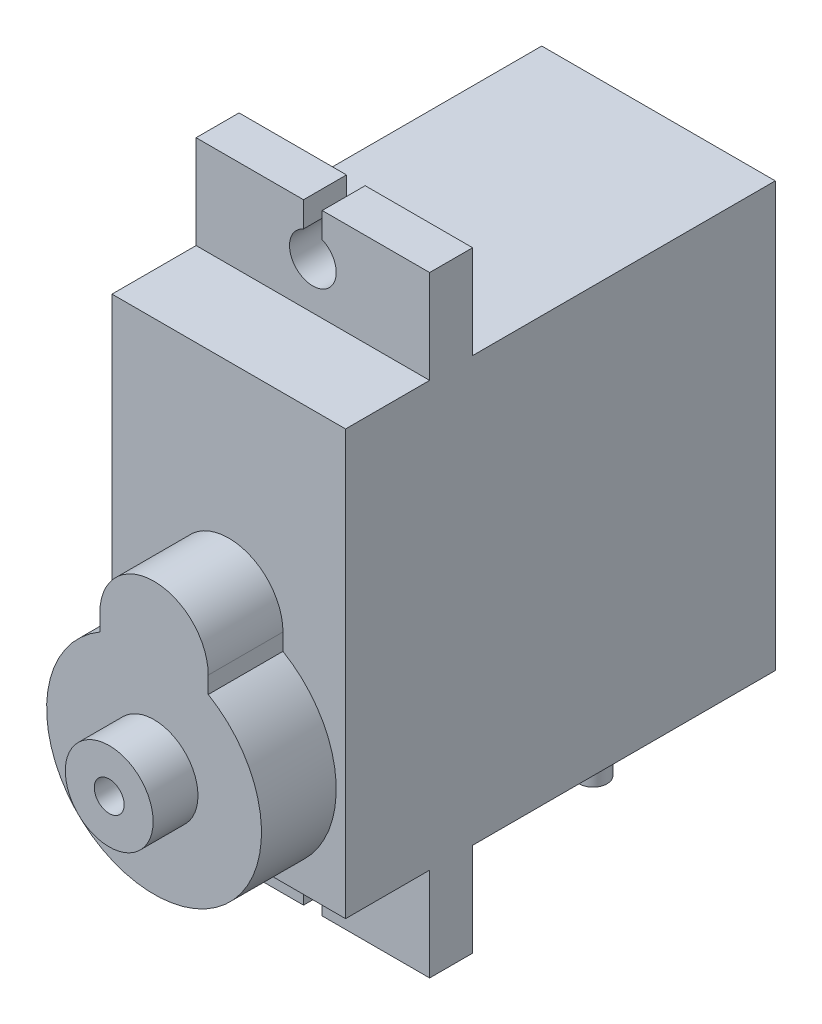
ISO-10303-21;
HEADER;
FILE_DESCRIPTION(('STEP AP214'),'2;1');
FILE_NAME('part.step','',(''),(''),'','','');
FILE_SCHEMA(('AUTOMOTIVE_DESIGN { 1 0 10303 214 1 1 1 1 }'));
ENDSEC;
DATA;
#1=APPLICATION_CONTEXT('core data for automotive mechanical design processes');
#2=APPLICATION_PROTOCOL_DEFINITION('international standard','automotive_design',2000,#1);
#3=PRODUCT_CONTEXT('',#1,'mechanical');
#4=PRODUCT('Part','Part','',(#3));
#5=PRODUCT_RELATED_PRODUCT_CATEGORY('part','',(#4));
#6=PRODUCT_DEFINITION_FORMATION('','',#4);
#7=PRODUCT_DEFINITION_CONTEXT('part definition',#1,'design');
#8=PRODUCT_DEFINITION('design','',#6,#7);
#9=PRODUCT_DEFINITION_SHAPE('','',#8);
#10=(LENGTH_UNIT() NAMED_UNIT(*) SI_UNIT(.MILLI.,.METRE.));
#11=(NAMED_UNIT(*) PLANE_ANGLE_UNIT() SI_UNIT($,.RADIAN.));
#12=(NAMED_UNIT(*) SI_UNIT($,.STERADIAN.) SOLID_ANGLE_UNIT());
#13=UNCERTAINTY_MEASURE_WITH_UNIT(LENGTH_MEASURE(1.E-05),#10,'distance_accuracy_value','');
#14=(GEOMETRIC_REPRESENTATION_CONTEXT(3) GLOBAL_UNCERTAINTY_ASSIGNED_CONTEXT((#13)) GLOBAL_UNIT_ASSIGNED_CONTEXT((#10,
#11,#12)) REPRESENTATION_CONTEXT('',''));
#15=CARTESIAN_POINT('',(0.,0.,0.));
#16=DIRECTION('',(0.,0.,1.));
#17=DIRECTION('',(1.,0.,0.));
#18=AXIS2_PLACEMENT_3D('',#15,#16,#17);
#19=CARTESIAN_POINT('',(-6.25000000000001,-11.35,23.));
#20=DIRECTION('',(0.,1.,0.));
#21=DIRECTION('',(0.,0.,1.));
#22=AXIS2_PLACEMENT_3D('',#19,#20,#21);
#23=PLANE('',#22);
#24=DIRECTION('',(-1.,0.,0.));
#25=VECTOR('',#24,1.);
#26=CARTESIAN_POINT('',(6.25,-11.35,16.2));
#27=LINE('',#26,#25);
#28=CARTESIAN_POINT('',(6.24999999999999,-11.35,16.2));
#29=VERTEX_POINT('',#28);
#30=CARTESIAN_POINT('',(-6.25,-11.35,16.2));
#31=VERTEX_POINT('',#30);
#32=EDGE_CURVE('E324',#29,#31,#27,.T.);
#33=ORIENTED_EDGE('',*,*,#32,.T.);
#34=DIRECTION('',(0.,0.,-1.));
#35=VECTOR('',#34,1.);
#36=CARTESIAN_POINT('',(-6.25000000000001,-11.35,23.));
#37=LINE('',#36,#35);
#38=CARTESIAN_POINT('',(-6.25000000000001,-11.35,0.));
#39=VERTEX_POINT('',#38);
#40=EDGE_CURVE('E399',#31,#39,#37,.T.);
#41=ORIENTED_EDGE('',*,*,#40,.T.);
#42=DIRECTION('',(1.,0.,0.));
#43=VECTOR('',#42,1.);
#44=CARTESIAN_POINT('',(-6.25000000000001,-11.35,0.));
#45=LINE('',#44,#43);
#46=CARTESIAN_POINT('',(6.24999999999999,-11.35,0.));
#47=VERTEX_POINT('',#46);
#48=EDGE_CURVE('E494',#39,#47,#45,.T.);
#49=ORIENTED_EDGE('',*,*,#48,.T.);
#50=DIRECTION('',(0.,0.,-1.));
#51=VECTOR('',#50,1.);
#52=CARTESIAN_POINT('',(6.24999999999999,-11.35,23.));
#53=LINE('',#52,#51);
#54=EDGE_CURVE('E487',#29,#47,#53,.T.);
#55=ORIENTED_EDGE('',*,*,#54,.F.);
#56=EDGE_LOOP('',(#33,#41,#49,#55));
#57=FACE_BOUND('',#56,.T.);
#58=CARTESIAN_POINT('',(1.25,-11.35,4.75));
#59=DIRECTION('',(0.,1.,0.));
#60=DIRECTION('',(0.,0.,1.));
#61=AXIS2_PLACEMENT_3D('',#58,#59,#60);
#62=CIRCLE('',#61,0.75);
#63=CARTESIAN_POINT('',(0.625,-11.35,4.33542190120558));
#64=VERTEX_POINT('',#63);
#65=CARTESIAN_POINT('',(0.625000000000001,-11.35,5.16457809879443));
#66=VERTEX_POINT('',#65);
#67=EDGE_CURVE('E236',#64,#66,#62,.F.);
#68=ORIENTED_EDGE('',*,*,#67,.F.);
#69=CARTESIAN_POINT('',(0.,-11.35,4.75));
#70=DIRECTION('',(0.,1.,0.));
#71=DIRECTION('',(0.,0.,1.));
#72=AXIS2_PLACEMENT_3D('',#69,#70,#71);
#73=CIRCLE('',#72,0.75);
#74=CARTESIAN_POINT('',(-0.625,-11.35,4.33542190120558));
#75=VERTEX_POINT('',#74);
#76=EDGE_CURVE('E248',#75,#64,#73,.F.);
#77=ORIENTED_EDGE('',*,*,#76,.F.);
#78=CARTESIAN_POINT('',(-1.25,-11.35,4.75));
#79=DIRECTION('',(0.,1.,0.));
#80=DIRECTION('',(0.,0.,1.));
#81=AXIS2_PLACEMENT_3D('',#78,#79,#80);
#82=CIRCLE('',#81,0.75);
#83=CARTESIAN_POINT('',(-0.625,-11.35,5.16457809879442));
#84=VERTEX_POINT('',#83);
#85=EDGE_CURVE('E235',#84,#75,#82,.F.);
#86=ORIENTED_EDGE('',*,*,#85,.F.);
#87=CARTESIAN_POINT('',(0.,-11.35,4.75));
#88=DIRECTION('',(0.,1.,0.));
#89=DIRECTION('',(0.,0.,1.));
#90=AXIS2_PLACEMENT_3D('',#87,#88,#89);
#91=CIRCLE('',#90,0.75);
#92=EDGE_CURVE('E225',#66,#84,#91,.F.);
#93=ORIENTED_EDGE('',*,*,#92,.F.);
#94=EDGE_LOOP('',(#68,#77,#86,#93));
#95=FACE_BOUND('',#94,.T.);
#96=ADVANCED_FACE('F35',(#57,#95),#23,.F.);
#97=CARTESIAN_POINT('',(6.25,-16.35,16.2));
#98=DIRECTION('',(0.,1.,0.));
#99=DIRECTION('',(0.,0.,1.));
#100=AXIS2_PLACEMENT_3D('',#97,#98,#99);
#101=PLANE('',#100);
#102=DIRECTION('',(-1.,0.,0.));
#103=VECTOR('',#102,1.);
#104=CARTESIAN_POINT('',(6.25,-16.35,18.5));
#105=LINE('',#104,#103);
#106=CARTESIAN_POINT('',(6.25,-16.35,18.5));
#107=VERTEX_POINT('',#106);
#108=CARTESIAN_POINT('',(0.5,-16.35,18.5));
#109=VERTEX_POINT('',#108);
#110=EDGE_CURVE('E339',#107,#109,#105,.T.);
#111=ORIENTED_EDGE('',*,*,#110,.T.);
#112=DIRECTION('',(0.,0.,1.));
#113=VECTOR('',#112,1.);
#114=CARTESIAN_POINT('',(0.5,-16.35,-0.00102500000000172));
#115=LINE('',#114,#113);
#116=CARTESIAN_POINT('',(0.5,-16.35,16.2));
#117=VERTEX_POINT('',#116);
#118=EDGE_CURVE('E287',#117,#109,#115,.T.);
#119=ORIENTED_EDGE('',*,*,#118,.F.);
#120=DIRECTION('',(-1.,0.,0.));
#121=VECTOR('',#120,1.);
#122=CARTESIAN_POINT('',(6.25,-16.35,16.2));
#123=LINE('',#122,#121);
#124=CARTESIAN_POINT('',(6.25,-16.35,16.2));
#125=VERTEX_POINT('',#124);
#126=EDGE_CURVE('E335',#125,#117,#123,.T.);
#127=ORIENTED_EDGE('',*,*,#126,.F.);
#128=DIRECTION('',(0.,0.,-1.));
#129=VECTOR('',#128,1.);
#130=CARTESIAN_POINT('',(6.25,-16.35,16.2));
#131=LINE('',#130,#129);
#132=EDGE_CURVE('E318',#107,#125,#131,.T.);
#133=ORIENTED_EDGE('',*,*,#132,.F.);
#134=EDGE_LOOP('',(#111,#119,#127,#133));
#135=FACE_BOUND('',#134,.T.);
#136=ADVANCED_FACE('F559',(#135),#101,.F.);
#137=CARTESIAN_POINT('',(6.25,16.35,16.2));
#138=DIRECTION('',(0.,-1.,0.));
#139=DIRECTION('',(0.,0.,-1.));
#140=AXIS2_PLACEMENT_3D('',#137,#138,#139);
#141=PLANE('',#140);
#142=DIRECTION('',(-1.,0.,0.));
#143=VECTOR('',#142,1.);
#144=CARTESIAN_POINT('',(6.25,16.35,16.2));
#145=LINE('',#144,#143);
#146=CARTESIAN_POINT('',(6.25,16.35,16.2));
#147=VERTEX_POINT('',#146);
#148=CARTESIAN_POINT('',(0.5,16.35,16.2));
#149=VERTEX_POINT('',#148);
#150=EDGE_CURVE('E453',#147,#149,#145,.T.);
#151=ORIENTED_EDGE('',*,*,#150,.T.);
#152=DIRECTION('',(0.,0.,1.));
#153=VECTOR('',#152,1.);
#154=CARTESIAN_POINT('',(0.5,16.35,-0.00102500000000172));
#155=LINE('',#154,#153);
#156=CARTESIAN_POINT('',(0.5,16.35,18.5));
#157=VERTEX_POINT('',#156);
#158=EDGE_CURVE('E307',#149,#157,#155,.T.);
#159=ORIENTED_EDGE('',*,*,#158,.T.);
#160=DIRECTION('',(-1.,0.,0.));
#161=VECTOR('',#160,1.);
#162=CARTESIAN_POINT('',(6.25,16.35,18.5));
#163=LINE('',#162,#161);
#164=CARTESIAN_POINT('',(6.25,16.35,18.5));
#165=VERTEX_POINT('',#164);
#166=EDGE_CURVE('E466',#165,#157,#163,.T.);
#167=ORIENTED_EDGE('',*,*,#166,.F.);
#168=DIRECTION('',(0.,0.,1.));
#169=VECTOR('',#168,1.);
#170=CARTESIAN_POINT('',(6.25,16.35,16.2));
#171=LINE('',#170,#169);
#172=EDGE_CURVE('E346',#147,#165,#171,.T.);
#173=ORIENTED_EDGE('',*,*,#172,.F.);
#174=EDGE_LOOP('',(#151,#159,#167,#173));
#175=FACE_BOUND('',#174,.T.);
#176=ADVANCED_FACE('F564',(#175),#141,.F.);
#177=DIRECTION('',(-1.,0.,0.));
#178=VECTOR('',#177,1.);
#179=CARTESIAN_POINT('',(6.25,-11.35,18.5));
#180=LINE('',#179,#178);
#181=CARTESIAN_POINT('',(6.24999999999999,-11.35,18.5));
#182=VERTEX_POINT('',#181);
#183=CARTESIAN_POINT('',(-6.25000000000001,-11.35,18.5));
#184=VERTEX_POINT('',#183);
#185=EDGE_CURVE('E342',#182,#184,#180,.T.);
#186=ORIENTED_EDGE('',*,*,#185,.F.);
#187=CARTESIAN_POINT('',(6.24999999999999,-11.35,23.));
#188=VERTEX_POINT('',#187);
#189=EDGE_CURVE('E496',#188,#182,#53,.T.);
#190=ORIENTED_EDGE('',*,*,#189,.F.);
#191=DIRECTION('',(1.,0.,0.));
#192=VECTOR('',#191,1.);
#193=CARTESIAN_POINT('',(-6.25000000000001,-11.35,23.));
#194=LINE('',#193,#192);
#195=CARTESIAN_POINT('',(0.,-11.35,23.));
#196=VERTEX_POINT('',#195);
#197=EDGE_CURVE('E479',#196,#188,#194,.T.);
#198=ORIENTED_EDGE('',*,*,#197,.F.);
#199=CARTESIAN_POINT('',(-6.25000000000001,-11.35,23.));
#200=VERTEX_POINT('',#199);
#201=EDGE_CURVE('E481',#200,#196,#194,.T.);
#202=ORIENTED_EDGE('',*,*,#201,.F.);
#203=EDGE_CURVE('E394',#200,#184,#37,.T.);
#204=ORIENTED_EDGE('',*,*,#203,.T.);
#205=EDGE_LOOP('',(#186,#190,#198,#202,#204));
#206=FACE_BOUND('',#205,.T.);
#207=ADVANCED_FACE('F521',(#206),#23,.F.);
#208=CARTESIAN_POINT('',(-6.25000000000001,11.35,23.));
#209=DIRECTION('',(0.,-1.,0.));
#210=DIRECTION('',(0.,0.,-1.));
#211=AXIS2_PLACEMENT_3D('',#208,#209,#210);
#212=PLANE('',#211);
#213=DIRECTION('',(-1.,0.,0.));
#214=VECTOR('',#213,1.);
#215=CARTESIAN_POINT('',(6.25,11.35,16.2));
#216=LINE('',#215,#214);
#217=CARTESIAN_POINT('',(6.25,11.35,16.2));
#218=VERTEX_POINT('',#217);
#219=CARTESIAN_POINT('',(-6.25,11.35,16.2));
#220=VERTEX_POINT('',#219);
#221=EDGE_CURVE('E359',#218,#220,#216,.T.);
#222=ORIENTED_EDGE('',*,*,#221,.F.);
#223=DIRECTION('',(0.,0.,-1.));
#224=VECTOR('',#223,1.);
#225=CARTESIAN_POINT('',(6.24999999999999,11.35,23.));
#226=LINE('',#225,#224);
#227=CARTESIAN_POINT('',(6.24999999999999,11.35,0.));
#228=VERTEX_POINT('',#227);
#229=EDGE_CURVE('E397',#218,#228,#226,.T.);
#230=ORIENTED_EDGE('',*,*,#229,.T.);
#231=DIRECTION('',(-1.,0.,0.));
#232=VECTOR('',#231,1.);
#233=CARTESIAN_POINT('',(-6.25000000000001,11.35,0.));
#234=LINE('',#233,#232);
#235=CARTESIAN_POINT('',(-6.25000000000001,11.35,0.));
#236=VERTEX_POINT('',#235);
#237=EDGE_CURVE('E391',#228,#236,#234,.T.);
#238=ORIENTED_EDGE('',*,*,#237,.T.);
#239=DIRECTION('',(0.,0.,-1.));
#240=VECTOR('',#239,1.);
#241=CARTESIAN_POINT('',(-6.25000000000001,11.35,23.));
#242=LINE('',#241,#240);
#243=EDGE_CURVE('E384',#220,#236,#242,.T.);
#244=ORIENTED_EDGE('',*,*,#243,.F.);
#245=EDGE_LOOP('',(#222,#230,#238,#244));
#246=FACE_BOUND('',#245,.T.);
#247=ADVANCED_FACE('F388',(#246),#212,.F.);
#248=CARTESIAN_POINT('',(0.,0.,23.));
#249=DIRECTION('',(0.,0.,-1.));
#250=DIRECTION('',(-1.,0.,0.));
#251=AXIS2_PLACEMENT_3D('',#248,#249,#250);
#252=PLANE('',#251);
#253=DIRECTION('',(0.,1.,0.));
#254=VECTOR('',#253,1.);
#255=CARTESIAN_POINT('',(2.9,0.26512839713135,23.));
#256=LINE('',#255,#254);
#257=CARTESIAN_POINT('',(2.9,-0.634871602868653,23.));
#258=VERTEX_POINT('',#257);
#259=CARTESIAN_POINT('',(2.9,0.26512839713135,23.));
#260=VERTEX_POINT('',#259);
#261=EDGE_CURVE('E442',#258,#260,#256,.T.);
#262=ORIENTED_EDGE('',*,*,#261,.F.);
#263=CARTESIAN_POINT('',(0.,-5.59999999999999,23.));
#264=DIRECTION('',(0.,0.,1.));
#265=DIRECTION('',(1.,0.,0.));
#266=AXIS2_PLACEMENT_3D('',#263,#264,#265);
#267=CIRCLE('',#266,5.75);
#268=EDGE_CURVE('E43',#196,#258,#267,.T.);
#269=ORIENTED_EDGE('',*,*,#268,.F.);
#270=ORIENTED_EDGE('',*,*,#197,.T.);
#271=DIRECTION('',(0.,1.,0.));
#272=VECTOR('',#271,1.);
#273=CARTESIAN_POINT('',(6.24999999999999,-11.35,23.));
#274=LINE('',#273,#272);
#275=CARTESIAN_POINT('',(6.24999999999999,11.35,23.));
#276=VERTEX_POINT('',#275);
#277=EDGE_CURVE('E483',#188,#276,#274,.T.);
#278=ORIENTED_EDGE('',*,*,#277,.T.);
#279=DIRECTION('',(-1.,0.,0.));
#280=VECTOR('',#279,1.);
#281=CARTESIAN_POINT('',(-6.25000000000001,11.35,23.));
#282=LINE('',#281,#280);
#283=CARTESIAN_POINT('',(-6.25000000000001,11.35,23.));
#284=VERTEX_POINT('',#283);
#285=EDGE_CURVE('E431',#276,#284,#282,.T.);
#286=ORIENTED_EDGE('',*,*,#285,.T.);
#287=DIRECTION('',(0.,-1.,0.));
#288=VECTOR('',#287,1.);
#289=CARTESIAN_POINT('',(-6.25000000000001,-11.35,23.));
#290=LINE('',#289,#288);
#291=EDGE_CURVE('E474',#284,#200,#290,.T.);
#292=ORIENTED_EDGE('',*,*,#291,.T.);
#293=ORIENTED_EDGE('',*,*,#201,.T.);
#294=CARTESIAN_POINT('',(-2.9,-0.634871602868654,23.));
#295=VERTEX_POINT('',#294);
#296=EDGE_CURVE('E435',#295,#196,#267,.T.);
#297=ORIENTED_EDGE('',*,*,#296,.F.);
#298=DIRECTION('',(0.,-1.,0.));
#299=VECTOR('',#298,1.);
#300=CARTESIAN_POINT('',(-2.9,0.26512839713135,23.));
#301=LINE('',#300,#299);
#302=CARTESIAN_POINT('',(-2.9,0.26512839713135,23.));
#303=VERTEX_POINT('',#302);
#304=EDGE_CURVE('E443',#303,#295,#301,.T.);
#305=ORIENTED_EDGE('',*,*,#304,.F.);
#306=CARTESIAN_POINT('',(0.,0.26512839713135,23.));
#307=DIRECTION('',(0.,0.,1.));
#308=DIRECTION('',(1.,0.,0.));
#309=AXIS2_PLACEMENT_3D('',#306,#307,#308);
#310=CIRCLE('',#309,2.9);
#311=EDGE_CURVE('E448',#260,#303,#310,.T.);
#312=ORIENTED_EDGE('',*,*,#311,.F.);
#313=EDGE_LOOP('',(#262,#269,#270,#278,#286,#292,#293,#297,#305,#312));
#314=FACE_BOUND('',#313,.T.);
#315=ADVANCED_FACE('F523',(#314),#252,.F.);
#316=CARTESIAN_POINT('',(6.24999999999999,-11.35,23.));
#317=DIRECTION('',(-1.,0.,0.));
#318=DIRECTION('',(0.,0.,1.));
#319=AXIS2_PLACEMENT_3D('',#316,#317,#318);
#320=PLANE('',#319);
#321=DIRECTION('',(0.,1.,0.));
#322=VECTOR('',#321,1.);
#323=CARTESIAN_POINT('',(6.24999999999999,-11.35,0.));
#324=LINE('',#323,#322);
#325=EDGE_CURVE('E488',#47,#228,#324,.T.);
#326=ORIENTED_EDGE('',*,*,#325,.T.);
#327=ORIENTED_EDGE('',*,*,#229,.F.);
#328=DIRECTION('',(0.,1.,0.));
#329=VECTOR('',#328,1.);
#330=CARTESIAN_POINT('',(6.25,11.35,16.2));
#331=LINE('',#330,#329);
#332=EDGE_CURVE('E349',#218,#147,#331,.T.);
#333=ORIENTED_EDGE('',*,*,#332,.T.);
#334=ORIENTED_EDGE('',*,*,#172,.T.);
#335=DIRECTION('',(0.,-1.,0.));
#336=VECTOR('',#335,1.);
#337=CARTESIAN_POINT('',(6.25,11.35,18.5));
#338=LINE('',#337,#336);
#339=CARTESIAN_POINT('',(6.25,11.35,18.5));
#340=VERTEX_POINT('',#339);
#341=EDGE_CURVE('E348',#165,#340,#338,.T.);
#342=ORIENTED_EDGE('',*,*,#341,.T.);
#343=EDGE_CURVE('E404',#276,#340,#226,.T.);
#344=ORIENTED_EDGE('',*,*,#343,.F.);
#345=ORIENTED_EDGE('',*,*,#277,.F.);
#346=ORIENTED_EDGE('',*,*,#189,.T.);
#347=DIRECTION('',(0.,-1.,0.));
#348=VECTOR('',#347,1.);
#349=CARTESIAN_POINT('',(6.25,-11.35,18.5));
#350=LINE('',#349,#348);
#351=EDGE_CURVE('E316',#182,#107,#350,.T.);
#352=ORIENTED_EDGE('',*,*,#351,.T.);
#353=ORIENTED_EDGE('',*,*,#132,.T.);
#354=DIRECTION('',(0.,1.,0.));
#355=VECTOR('',#354,1.);
#356=CARTESIAN_POINT('',(6.25,-11.35,16.2));
#357=LINE('',#356,#355);
#358=EDGE_CURVE('E321',#125,#29,#357,.T.);
#359=ORIENTED_EDGE('',*,*,#358,.T.);
#360=ORIENTED_EDGE('',*,*,#54,.T.);
#361=EDGE_LOOP('',(#326,#327,#333,#334,#342,#344,#345,#346,#352,#353,#359,#360));
#362=FACE_BOUND('',#361,.T.);
#363=ADVANCED_FACE('F37',(#362),#320,.F.);
#364=ORIENTED_EDGE('',*,*,#343,.T.);
#365=DIRECTION('',(-1.,0.,0.));
#366=VECTOR('',#365,1.);
#367=CARTESIAN_POINT('',(6.25,11.35,18.5));
#368=LINE('',#367,#366);
#369=CARTESIAN_POINT('',(-6.25000000000001,11.35,18.5));
#370=VERTEX_POINT('',#369);
#371=EDGE_CURVE('E362',#340,#370,#368,.T.);
#372=ORIENTED_EDGE('',*,*,#371,.T.);
#373=EDGE_CURVE('E393',#284,#370,#242,.T.);
#374=ORIENTED_EDGE('',*,*,#373,.F.);
#375=ORIENTED_EDGE('',*,*,#285,.F.);
#376=EDGE_LOOP('',(#364,#372,#374,#375));
#377=FACE_BOUND('',#376,.T.);
#378=ADVANCED_FACE('F430',(#377),#212,.F.);
#379=CARTESIAN_POINT('',(-6.25000000000001,-11.35,23.));
#380=DIRECTION('',(1.,0.,0.));
#381=DIRECTION('',(0.,0.,-1.));
#382=AXIS2_PLACEMENT_3D('',#379,#380,#381);
#383=PLANE('',#382);
#384=DIRECTION('',(0.,-1.,0.));
#385=VECTOR('',#384,1.);
#386=CARTESIAN_POINT('',(-6.25000000000001,-11.35,0.));
#387=LINE('',#386,#385);
#388=EDGE_CURVE('E492',#236,#39,#387,.T.);
#389=ORIENTED_EDGE('',*,*,#388,.T.);
#390=ORIENTED_EDGE('',*,*,#40,.F.);
#391=DIRECTION('',(0.,1.,0.));
#392=VECTOR('',#391,1.);
#393=CARTESIAN_POINT('',(-6.25,-11.35,16.2));
#394=LINE('',#393,#392);
#395=CARTESIAN_POINT('',(-6.25,-16.35,16.2));
#396=VERTEX_POINT('',#395);
#397=EDGE_CURVE('E319',#396,#31,#394,.T.);
#398=ORIENTED_EDGE('',*,*,#397,.F.);
#399=DIRECTION('',(0.,0.,-1.));
#400=VECTOR('',#399,1.);
#401=CARTESIAN_POINT('',(-6.25,-16.35,16.2));
#402=LINE('',#401,#400);
#403=CARTESIAN_POINT('',(-6.25,-16.35,18.5));
#404=VERTEX_POINT('',#403);
#405=EDGE_CURVE('E327',#404,#396,#402,.T.);
#406=ORIENTED_EDGE('',*,*,#405,.F.);
#407=DIRECTION('',(0.,-1.,0.));
#408=VECTOR('',#407,1.);
#409=CARTESIAN_POINT('',(-6.25,-11.35,18.5));
#410=LINE('',#409,#408);
#411=EDGE_CURVE('E310',#184,#404,#410,.T.);
#412=ORIENTED_EDGE('',*,*,#411,.F.);
#413=ORIENTED_EDGE('',*,*,#203,.F.);
#414=ORIENTED_EDGE('',*,*,#291,.F.);
#415=ORIENTED_EDGE('',*,*,#373,.T.);
#416=DIRECTION('',(0.,-1.,0.));
#417=VECTOR('',#416,1.);
#418=CARTESIAN_POINT('',(-6.25,11.35,18.5));
#419=LINE('',#418,#417);
#420=CARTESIAN_POINT('',(-6.25,16.35,18.5));
#421=VERTEX_POINT('',#420);
#422=EDGE_CURVE('E353',#421,#370,#419,.T.);
#423=ORIENTED_EDGE('',*,*,#422,.F.);
#424=DIRECTION('',(0.,0.,1.));
#425=VECTOR('',#424,1.);
#426=CARTESIAN_POINT('',(-6.25,16.35,16.2));
#427=LINE('',#426,#425);
#428=CARTESIAN_POINT('',(-6.25,16.35,16.2));
#429=VERTEX_POINT('',#428);
#430=EDGE_CURVE('E350',#429,#421,#427,.T.);
#431=ORIENTED_EDGE('',*,*,#430,.F.);
#432=DIRECTION('',(0.,1.,0.));
#433=VECTOR('',#432,1.);
#434=CARTESIAN_POINT('',(-6.25,11.35,16.2));
#435=LINE('',#434,#433);
#436=EDGE_CURVE('E345',#220,#429,#435,.T.);
#437=ORIENTED_EDGE('',*,*,#436,.F.);
#438=ORIENTED_EDGE('',*,*,#243,.T.);
#439=EDGE_LOOP('',(#389,#390,#398,#406,#412,#413,#414,#415,#423,#431,#437,#438));
#440=FACE_BOUND('',#439,.T.);
#441=ADVANCED_FACE('F383',(#440),#383,.F.);
#442=CARTESIAN_POINT('',(0.,0.,0.));
#443=DIRECTION('',(0.,0.,-1.));
#444=DIRECTION('',(-1.,0.,0.));
#445=AXIS2_PLACEMENT_3D('',#442,#443,#444);
#446=PLANE('',#445);
#447=ORIENTED_EDGE('',*,*,#325,.F.);
#448=ORIENTED_EDGE('',*,*,#48,.F.);
#449=ORIENTED_EDGE('',*,*,#388,.F.);
#450=ORIENTED_EDGE('',*,*,#237,.F.);
#451=EDGE_LOOP('',(#447,#448,#449,#450));
#452=FACE_BOUND('',#451,.T.);
#453=ADVANCED_FACE('F506',(#452),#446,.T.);
#454=CARTESIAN_POINT('',(0.,0.26512839713135,27.));
#455=DIRECTION('',(0.,0.,-1.));
#456=DIRECTION('',(-1.,0.,0.));
#457=AXIS2_PLACEMENT_3D('',#454,#455,#456);
#458=CYLINDRICAL_SURFACE('',#457,2.9);
#459=ORIENTED_EDGE('',*,*,#311,.T.);
#460=DIRECTION('',(0.,0.,-1.));
#461=VECTOR('',#460,1.);
#462=CARTESIAN_POINT('',(-2.9,0.26512839713135,27.));
#463=LINE('',#462,#461);
#464=CARTESIAN_POINT('',(-2.9,0.26512839713135,27.));
#465=VERTEX_POINT('',#464);
#466=EDGE_CURVE('E490',#465,#303,#463,.T.);
#467=ORIENTED_EDGE('',*,*,#466,.F.);
#468=CARTESIAN_POINT('',(0.,0.26512839713135,27.));
#469=DIRECTION('',(0.,0.,1.));
#470=DIRECTION('',(1.,0.,0.));
#471=AXIS2_PLACEMENT_3D('',#468,#469,#470);
#472=CIRCLE('',#471,2.9);
#473=CARTESIAN_POINT('',(2.9,0.26512839713135,27.));
#474=VERTEX_POINT('',#473);
#475=EDGE_CURVE('E446',#474,#465,#472,.T.);
#476=ORIENTED_EDGE('',*,*,#475,.F.);
#477=DIRECTION('',(0.,0.,-1.));
#478=VECTOR('',#477,1.);
#479=CARTESIAN_POINT('',(2.9,0.26512839713135,27.));
#480=LINE('',#479,#478);
#481=EDGE_CURVE('E458',#474,#260,#480,.T.);
#482=ORIENTED_EDGE('',*,*,#481,.T.);
#483=EDGE_LOOP('',(#459,#467,#476,#482));
#484=FACE_BOUND('',#483,.T.);
#485=ADVANCED_FACE('F531',(#484),#458,.T.);
#486=CARTESIAN_POINT('',(-2.9,0.26512839713135,27.));
#487=DIRECTION('',(1.,0.,0.));
#488=DIRECTION('',(0.,0.,-1.));
#489=AXIS2_PLACEMENT_3D('',#486,#487,#488);
#490=PLANE('',#489);
#491=ORIENTED_EDGE('',*,*,#304,.T.);
#492=DIRECTION('',(0.,0.,-1.));
#493=VECTOR('',#492,1.);
#494=CARTESIAN_POINT('',(-2.9,-0.634871602868654,27.));
#495=LINE('',#494,#493);
#496=CARTESIAN_POINT('',(-2.9,-0.634871602868654,27.));
#497=VERTEX_POINT('',#496);
#498=EDGE_CURVE('E528',#497,#295,#495,.T.);
#499=ORIENTED_EDGE('',*,*,#498,.F.);
#500=DIRECTION('',(0.,-1.,0.));
#501=VECTOR('',#500,1.);
#502=CARTESIAN_POINT('',(-2.9,0.26512839713135,27.));
#503=LINE('',#502,#501);
#504=EDGE_CURVE('E461',#465,#497,#503,.T.);
#505=ORIENTED_EDGE('',*,*,#504,.F.);
#506=ORIENTED_EDGE('',*,*,#466,.T.);
#507=EDGE_LOOP('',(#491,#499,#505,#506));
#508=FACE_BOUND('',#507,.T.);
#509=ADVANCED_FACE('F525',(#508),#490,.F.);
#510=CARTESIAN_POINT('',(0.,-5.59999999999999,27.));
#511=DIRECTION('',(0.,0.,-1.));
#512=DIRECTION('',(-1.,0.,0.));
#513=AXIS2_PLACEMENT_3D('',#510,#511,#512);
#514=CYLINDRICAL_SURFACE('',#513,5.75);
#515=ORIENTED_EDGE('',*,*,#296,.T.);
#516=ORIENTED_EDGE('',*,*,#268,.T.);
#517=DIRECTION('',(0.,0.,-1.));
#518=VECTOR('',#517,1.);
#519=CARTESIAN_POINT('',(2.9,-0.634871602868653,27.));
#520=LINE('',#519,#518);
#521=CARTESIAN_POINT('',(2.9,-0.634871602868653,27.));
#522=VERTEX_POINT('',#521);
#523=EDGE_CURVE('E535',#522,#258,#520,.T.);
#524=ORIENTED_EDGE('',*,*,#523,.F.);
#525=CARTESIAN_POINT('',(0.,-5.59999999999999,27.));
#526=DIRECTION('',(0.,0.,1.));
#527=DIRECTION('',(1.,0.,0.));
#528=AXIS2_PLACEMENT_3D('',#525,#526,#527);
#529=CIRCLE('',#528,5.75);
#530=EDGE_CURVE('E459',#497,#522,#529,.T.);
#531=ORIENTED_EDGE('',*,*,#530,.F.);
#532=ORIENTED_EDGE('',*,*,#498,.T.);
#533=EDGE_LOOP('',(#515,#516,#524,#531,#532));
#534=FACE_BOUND('',#533,.T.);
#535=ADVANCED_FACE('F541',(#534),#514,.T.);
#536=CARTESIAN_POINT('',(2.9,0.26512839713135,27.));
#537=DIRECTION('',(-1.,0.,0.));
#538=DIRECTION('',(0.,0.,1.));
#539=AXIS2_PLACEMENT_3D('',#536,#537,#538);
#540=PLANE('',#539);
#541=ORIENTED_EDGE('',*,*,#261,.T.);
#542=ORIENTED_EDGE('',*,*,#481,.F.);
#543=DIRECTION('',(0.,1.,0.));
#544=VECTOR('',#543,1.);
#545=CARTESIAN_POINT('',(2.9,0.26512839713135,27.));
#546=LINE('',#545,#544);
#547=EDGE_CURVE('E456',#522,#474,#546,.T.);
#548=ORIENTED_EDGE('',*,*,#547,.F.);
#549=ORIENTED_EDGE('',*,*,#523,.T.);
#550=EDGE_LOOP('',(#541,#542,#548,#549));
#551=FACE_BOUND('',#550,.T.);
#552=ADVANCED_FACE('F539',(#551),#540,.F.);
#553=CARTESIAN_POINT('',(0.,0.26512839713135,27.));
#554=DIRECTION('',(0.,0.,1.));
#555=DIRECTION('',(1.,0.,0.));
#556=AXIS2_PLACEMENT_3D('',#553,#554,#555);
#557=PLANE('',#556);
#558=CARTESIAN_POINT('',(0.,-5.59999999999999,27.));
#559=DIRECTION('',(0.,0.,1.));
#560=DIRECTION('',(1.,0.,0.));
#561=AXIS2_PLACEMENT_3D('',#558,#559,#560);
#562=CIRCLE('',#561,2.35);
#563=CARTESIAN_POINT('',(2.35,-5.59999999999999,27.));
#564=VERTEX_POINT('',#563);
#565=EDGE_CURVE('E264',#564,#564,#562,.T.);
#566=ORIENTED_EDGE('',*,*,#565,.F.);
#567=EDGE_LOOP('',(#566));
#568=FACE_BOUND('',#567,.T.);
#569=ORIENTED_EDGE('',*,*,#475,.T.);
#570=ORIENTED_EDGE('',*,*,#504,.T.);
#571=ORIENTED_EDGE('',*,*,#530,.T.);
#572=ORIENTED_EDGE('',*,*,#547,.T.);
#573=EDGE_LOOP('',(#569,#570,#571,#572));
#574=FACE_BOUND('',#573,.T.);
#575=ADVANCED_FACE('F543',(#568,#574),#557,.T.);
#576=CARTESIAN_POINT('',(6.25,11.35,16.2));
#577=DIRECTION('',(0.,0.,1.));
#578=DIRECTION('',(1.,0.,0.));
#579=AXIS2_PLACEMENT_3D('',#576,#577,#578);
#580=PLANE('',#579);
#581=CARTESIAN_POINT('',(0.,13.85,16.2));
#582=DIRECTION('',(0.,0.,1.));
#583=DIRECTION('',(1.,0.,0.));
#584=AXIS2_PLACEMENT_3D('',#581,#582,#583);
#585=CIRCLE('',#584,1.25);
#586=CARTESIAN_POINT('',(0.500000000000001,14.995643923739,16.2));
#587=VERTEX_POINT('',#586);
#588=CARTESIAN_POINT('',(-0.5,14.995643923739,16.2));
#589=VERTEX_POINT('',#588);
#590=EDGE_CURVE('E294',#587,#589,#585,.F.);
#591=ORIENTED_EDGE('',*,*,#590,.F.);
#592=DIRECTION('',(0.,-1.,0.));
#593=VECTOR('',#592,1.);
#594=CARTESIAN_POINT('',(0.5,16.35,16.2));
#595=LINE('',#594,#593);
#596=EDGE_CURVE('E297',#149,#587,#595,.T.);
#597=ORIENTED_EDGE('',*,*,#596,.F.);
#598=ORIENTED_EDGE('',*,*,#150,.F.);
#599=ORIENTED_EDGE('',*,*,#332,.F.);
#600=ORIENTED_EDGE('',*,*,#221,.T.);
#601=ORIENTED_EDGE('',*,*,#436,.T.);
#602=CARTESIAN_POINT('',(-0.5,16.35,16.2));
#603=VERTEX_POINT('',#602);
#604=EDGE_CURVE('E377',#603,#429,#145,.T.);
#605=ORIENTED_EDGE('',*,*,#604,.F.);
#606=DIRECTION('',(0.,1.,0.));
#607=VECTOR('',#606,1.);
#608=CARTESIAN_POINT('',(-0.5,16.35,16.2));
#609=LINE('',#608,#607);
#610=EDGE_CURVE('E292',#589,#603,#609,.T.);
#611=ORIENTED_EDGE('',*,*,#610,.F.);
#612=EDGE_LOOP('',(#591,#597,#598,#599,#600,#601,#605,#611));
#613=FACE_BOUND('',#612,.T.);
#614=ADVANCED_FACE('F375',(#613),#580,.F.);
#615=CARTESIAN_POINT('',(-0.5,16.35,18.5));
#616=VERTEX_POINT('',#615);
#617=EDGE_CURVE('E414',#616,#421,#163,.T.);
#618=ORIENTED_EDGE('',*,*,#617,.F.);
#619=DIRECTION('',(0.,0.,1.));
#620=VECTOR('',#619,1.);
#621=CARTESIAN_POINT('',(-0.5,16.35,-0.00102500000000172));
#622=LINE('',#621,#620);
#623=EDGE_CURVE('E58',#603,#616,#622,.T.);
#624=ORIENTED_EDGE('',*,*,#623,.F.);
#625=ORIENTED_EDGE('',*,*,#604,.T.);
#626=ORIENTED_EDGE('',*,*,#430,.T.);
#627=EDGE_LOOP('',(#618,#624,#625,#626));
#628=FACE_BOUND('',#627,.T.);
#629=ADVANCED_FACE('F471',(#628),#141,.F.);
#630=CARTESIAN_POINT('',(6.25,11.35,18.5));
#631=DIRECTION('',(0.,0.,-1.));
#632=DIRECTION('',(-1.,0.,0.));
#633=AXIS2_PLACEMENT_3D('',#630,#631,#632);
#634=PLANE('',#633);
#635=ORIENTED_EDGE('',*,*,#166,.T.);
#636=DIRECTION('',(0.,1.,0.));
#637=VECTOR('',#636,1.);
#638=CARTESIAN_POINT('',(0.5,16.35,18.5));
#639=LINE('',#638,#637);
#640=CARTESIAN_POINT('',(0.500000000000001,14.995643923739,18.5));
#641=VERTEX_POINT('',#640);
#642=EDGE_CURVE('E300',#641,#157,#639,.T.);
#643=ORIENTED_EDGE('',*,*,#642,.F.);
#644=CARTESIAN_POINT('',(0.,13.85,18.5));
#645=DIRECTION('',(0.,0.,1.));
#646=DIRECTION('',(1.,0.,0.));
#647=AXIS2_PLACEMENT_3D('',#644,#645,#646);
#648=CIRCLE('',#647,1.25);
#649=CARTESIAN_POINT('',(-0.5,14.995643923739,18.5));
#650=VERTEX_POINT('',#649);
#651=EDGE_CURVE('E304',#650,#641,#648,.T.);
#652=ORIENTED_EDGE('',*,*,#651,.F.);
#653=DIRECTION('',(0.,-1.,0.));
#654=VECTOR('',#653,1.);
#655=CARTESIAN_POINT('',(-0.5,16.35,18.5));
#656=LINE('',#655,#654);
#657=EDGE_CURVE('E302',#616,#650,#656,.T.);
#658=ORIENTED_EDGE('',*,*,#657,.F.);
#659=ORIENTED_EDGE('',*,*,#617,.T.);
#660=ORIENTED_EDGE('',*,*,#422,.T.);
#661=ORIENTED_EDGE('',*,*,#371,.F.);
#662=ORIENTED_EDGE('',*,*,#341,.F.);
#663=EDGE_LOOP('',(#635,#643,#652,#658,#659,#660,#661,#662));
#664=FACE_BOUND('',#663,.T.);
#665=ADVANCED_FACE('F427',(#664),#634,.F.);
#666=CARTESIAN_POINT('',(6.25,-11.35,18.5));
#667=DIRECTION('',(0.,0.,-1.));
#668=DIRECTION('',(0.,1.,0.));
#669=AXIS2_PLACEMENT_3D('',#666,#667,#668);
#670=PLANE('',#669);
#671=CARTESIAN_POINT('',(0.,-13.85,18.5));
#672=DIRECTION('',(0.,0.,1.));
#673=DIRECTION('',(-1.,0.,0.));
#674=AXIS2_PLACEMENT_3D('',#671,#672,#673);
#675=CIRCLE('',#674,1.25);
#676=CARTESIAN_POINT('',(0.5,-14.9956439237389,18.5));
#677=VERTEX_POINT('',#676);
#678=CARTESIAN_POINT('',(-0.5,-14.995643923739,18.5));
#679=VERTEX_POINT('',#678);
#680=EDGE_CURVE('E275',#677,#679,#675,.T.);
#681=ORIENTED_EDGE('',*,*,#680,.F.);
#682=DIRECTION('',(0.,1.,0.));
#683=VECTOR('',#682,1.);
#684=CARTESIAN_POINT('',(0.5,-16.35,18.5));
#685=LINE('',#684,#683);
#686=EDGE_CURVE('E280',#109,#677,#685,.T.);
#687=ORIENTED_EDGE('',*,*,#686,.F.);
#688=ORIENTED_EDGE('',*,*,#110,.F.);
#689=ORIENTED_EDGE('',*,*,#351,.F.);
#690=ORIENTED_EDGE('',*,*,#185,.T.);
#691=ORIENTED_EDGE('',*,*,#411,.T.);
#692=CARTESIAN_POINT('',(-0.5,-16.35,18.5));
#693=VERTEX_POINT('',#692);
#694=EDGE_CURVE('E338',#693,#404,#105,.T.);
#695=ORIENTED_EDGE('',*,*,#694,.F.);
#696=DIRECTION('',(0.,-1.,0.));
#697=VECTOR('',#696,1.);
#698=CARTESIAN_POINT('',(-0.5,-16.35,18.5));
#699=LINE('',#698,#697);
#700=EDGE_CURVE('E278',#679,#693,#699,.T.);
#701=ORIENTED_EDGE('',*,*,#700,.F.);
#702=EDGE_LOOP('',(#681,#687,#688,#689,#690,#691,#695,#701));
#703=FACE_BOUND('',#702,.T.);
#704=ADVANCED_FACE('F518',(#703),#670,.F.);
#705=CARTESIAN_POINT('',(-0.5,-16.35,16.2));
#706=VERTEX_POINT('',#705);
#707=EDGE_CURVE('E334',#706,#396,#123,.T.);
#708=ORIENTED_EDGE('',*,*,#707,.F.);
#709=DIRECTION('',(0.,0.,1.));
#710=VECTOR('',#709,1.);
#711=CARTESIAN_POINT('',(-0.5,-16.35,-0.00102500000000172));
#712=LINE('',#711,#710);
#713=EDGE_CURVE('E50',#706,#693,#712,.T.);
#714=ORIENTED_EDGE('',*,*,#713,.T.);
#715=ORIENTED_EDGE('',*,*,#694,.T.);
#716=ORIENTED_EDGE('',*,*,#405,.T.);
#717=EDGE_LOOP('',(#708,#714,#715,#716));
#718=FACE_BOUND('',#717,.T.);
#719=ADVANCED_FACE('F514',(#718),#101,.F.);
#720=CARTESIAN_POINT('',(6.25,-11.35,16.2));
#721=DIRECTION('',(0.,0.,1.));
#722=DIRECTION('',(0.,-1.,0.));
#723=AXIS2_PLACEMENT_3D('',#720,#721,#722);
#724=PLANE('',#723);
#725=ORIENTED_EDGE('',*,*,#126,.T.);
#726=DIRECTION('',(0.,-1.,0.));
#727=VECTOR('',#726,1.);
#728=CARTESIAN_POINT('',(0.5,-16.35,16.2));
#729=LINE('',#728,#727);
#730=CARTESIAN_POINT('',(0.5,-14.9956439237389,16.2));
#731=VERTEX_POINT('',#730);
#732=EDGE_CURVE('E273',#731,#117,#729,.T.);
#733=ORIENTED_EDGE('',*,*,#732,.F.);
#734=CARTESIAN_POINT('',(0.,-13.85,16.2));
#735=DIRECTION('',(0.,0.,1.));
#736=DIRECTION('',(0.,-1.,0.));
#737=AXIS2_PLACEMENT_3D('',#734,#735,#736);
#738=CIRCLE('',#737,1.25);
#739=CARTESIAN_POINT('',(-0.5,-14.995643923739,16.2));
#740=VERTEX_POINT('',#739);
#741=EDGE_CURVE('E268',#740,#731,#738,.F.);
#742=ORIENTED_EDGE('',*,*,#741,.F.);
#743=DIRECTION('',(0.,1.,0.));
#744=VECTOR('',#743,1.);
#745=CARTESIAN_POINT('',(-0.5,-16.35,16.2));
#746=LINE('',#745,#744);
#747=EDGE_CURVE('E286',#706,#740,#746,.T.);
#748=ORIENTED_EDGE('',*,*,#747,.F.);
#749=ORIENTED_EDGE('',*,*,#707,.T.);
#750=ORIENTED_EDGE('',*,*,#397,.T.);
#751=ORIENTED_EDGE('',*,*,#32,.F.);
#752=ORIENTED_EDGE('',*,*,#358,.F.);
#753=EDGE_LOOP('',(#725,#733,#742,#748,#749,#750,#751,#752));
#754=FACE_BOUND('',#753,.T.);
#755=ADVANCED_FACE('F510',(#754),#724,.F.);
#756=CARTESIAN_POINT('',(0.5,16.35,-0.00102500000000172));
#757=DIRECTION('',(1.,0.,0.));
#758=DIRECTION('',(0.,0.,-1.));
#759=AXIS2_PLACEMENT_3D('',#756,#757,#758);
#760=PLANE('',#759);
#761=ORIENTED_EDGE('',*,*,#596,.T.);
#762=DIRECTION('',(0.,0.,1.));
#763=VECTOR('',#762,1.);
#764=CARTESIAN_POINT('',(0.500000000000001,14.995643923739,-0.00102500000000172));
#765=LINE('',#764,#763);
#766=EDGE_CURVE('E308',#587,#641,#765,.T.);
#767=ORIENTED_EDGE('',*,*,#766,.T.);
#768=ORIENTED_EDGE('',*,*,#642,.T.);
#769=ORIENTED_EDGE('',*,*,#158,.F.);
#770=EDGE_LOOP('',(#761,#767,#768,#769));
#771=FACE_BOUND('',#770,.T.);
#772=ADVANCED_FACE('F591',(#771),#760,.F.);
#773=CARTESIAN_POINT('',(0.,13.85,-0.00102500000000172));
#774=DIRECTION('',(0.,0.,1.));
#775=DIRECTION('',(1.,0.,0.));
#776=AXIS2_PLACEMENT_3D('',#773,#774,#775);
#777=CYLINDRICAL_SURFACE('',#776,1.25);
#778=ORIENTED_EDGE('',*,*,#590,.T.);
#779=DIRECTION('',(0.,0.,1.));
#780=VECTOR('',#779,1.);
#781=CARTESIAN_POINT('',(-0.5,14.995643923739,-0.00102500000000172));
#782=LINE('',#781,#780);
#783=EDGE_CURVE('E311',#589,#650,#782,.T.);
#784=ORIENTED_EDGE('',*,*,#783,.T.);
#785=ORIENTED_EDGE('',*,*,#651,.T.);
#786=ORIENTED_EDGE('',*,*,#766,.F.);
#787=EDGE_LOOP('',(#778,#784,#785,#786));
#788=FACE_BOUND('',#787,.T.);
#789=ADVANCED_FACE('F594',(#788),#777,.F.);
#790=CARTESIAN_POINT('',(-0.5,16.35,-0.00102500000000172));
#791=DIRECTION('',(-1.,0.,0.));
#792=DIRECTION('',(0.,-1.,0.));
#793=AXIS2_PLACEMENT_3D('',#790,#791,#792);
#794=PLANE('',#793);
#795=ORIENTED_EDGE('',*,*,#610,.T.);
#796=ORIENTED_EDGE('',*,*,#623,.T.);
#797=ORIENTED_EDGE('',*,*,#657,.T.);
#798=ORIENTED_EDGE('',*,*,#783,.F.);
#799=EDGE_LOOP('',(#795,#796,#797,#798));
#800=FACE_BOUND('',#799,.T.);
#801=ADVANCED_FACE('F596',(#800),#794,.F.);
#802=CARTESIAN_POINT('',(0.,-13.85,-0.00102500000000172));
#803=DIRECTION('',(0.,0.,1.));
#804=DIRECTION('',(1.,0.,0.));
#805=AXIS2_PLACEMENT_3D('',#802,#803,#804);
#806=CYLINDRICAL_SURFACE('',#805,1.25);
#807=ORIENTED_EDGE('',*,*,#741,.T.);
#808=DIRECTION('',(0.,0.,1.));
#809=VECTOR('',#808,1.);
#810=CARTESIAN_POINT('',(0.5,-14.9956439237389,-0.00102500000000172));
#811=LINE('',#810,#809);
#812=EDGE_CURVE('E284',#731,#677,#811,.T.);
#813=ORIENTED_EDGE('',*,*,#812,.T.);
#814=ORIENTED_EDGE('',*,*,#680,.T.);
#815=DIRECTION('',(0.,0.,1.));
#816=VECTOR('',#815,1.);
#817=CARTESIAN_POINT('',(-0.5,-14.995643923739,-0.00102500000000172));
#818=LINE('',#817,#816);
#819=EDGE_CURVE('E283',#740,#679,#818,.T.);
#820=ORIENTED_EDGE('',*,*,#819,.F.);
#821=EDGE_LOOP('',(#807,#813,#814,#820));
#822=FACE_BOUND('',#821,.T.);
#823=ADVANCED_FACE('F599',(#822),#806,.F.);
#824=CARTESIAN_POINT('',(0.5,-16.35,-0.00102500000000172));
#825=DIRECTION('',(1.,0.,0.));
#826=DIRECTION('',(0.,0.,-1.));
#827=AXIS2_PLACEMENT_3D('',#824,#825,#826);
#828=PLANE('',#827);
#829=ORIENTED_EDGE('',*,*,#732,.T.);
#830=ORIENTED_EDGE('',*,*,#118,.T.);
#831=ORIENTED_EDGE('',*,*,#686,.T.);
#832=ORIENTED_EDGE('',*,*,#812,.F.);
#833=EDGE_LOOP('',(#829,#830,#831,#832));
#834=FACE_BOUND('',#833,.T.);
#835=ADVANCED_FACE('F605',(#834),#828,.F.);
#836=CARTESIAN_POINT('',(-0.5,-16.35,-0.00102500000000172));
#837=DIRECTION('',(-1.,0.,0.));
#838=DIRECTION('',(0.,-1.,0.));
#839=AXIS2_PLACEMENT_3D('',#836,#837,#838);
#840=PLANE('',#839);
#841=ORIENTED_EDGE('',*,*,#747,.T.);
#842=ORIENTED_EDGE('',*,*,#819,.T.);
#843=ORIENTED_EDGE('',*,*,#700,.T.);
#844=ORIENTED_EDGE('',*,*,#713,.F.);
#845=EDGE_LOOP('',(#841,#842,#843,#844));
#846=FACE_BOUND('',#845,.T.);
#847=ADVANCED_FACE('F607',(#846),#840,.F.);
#848=CARTESIAN_POINT('',(0.,-5.59999999999999,29.4));
#849=DIRECTION('',(0.,0.,1.));
#850=DIRECTION('',(1.,0.,0.));
#851=AXIS2_PLACEMENT_3D('',#848,#849,#850);
#852=PLANE('',#851);
#853=CARTESIAN_POINT('',(0.,-5.59999999999999,29.4));
#854=DIRECTION('',(0.,0.,1.));
#855=DIRECTION('',(1.,0.,0.));
#856=AXIS2_PLACEMENT_3D('',#853,#854,#855);
#857=CIRCLE('',#856,2.35);
#858=CARTESIAN_POINT('',(2.35,-5.59999999999999,29.4));
#859=VERTEX_POINT('',#858);
#860=EDGE_CURVE('E265',#859,#859,#857,.T.);
#861=ORIENTED_EDGE('',*,*,#860,.T.);
#862=EDGE_LOOP('',(#861));
#863=FACE_BOUND('',#862,.T.);
#864=CARTESIAN_POINT('',(0.,-5.59999999999999,29.4));
#865=DIRECTION('',(0.,0.,1.));
#866=DIRECTION('',(1.,0.,0.));
#867=AXIS2_PLACEMENT_3D('',#864,#865,#866);
#868=CIRCLE('',#867,0.8);
#869=CARTESIAN_POINT('',(0.8,-5.59999999999999,29.4));
#870=VERTEX_POINT('',#869);
#871=EDGE_CURVE('E250',#870,#870,#868,.T.);
#872=ORIENTED_EDGE('',*,*,#871,.F.);
#873=EDGE_LOOP('',(#872));
#874=FACE_BOUND('',#873,.T.);
#875=ADVANCED_FACE('F610',(#863,#874),#852,.T.);
#876=CARTESIAN_POINT('',(0.,-5.59999999999999,29.4));
#877=DIRECTION('',(0.,0.,-1.));
#878=DIRECTION('',(-1.,0.,0.));
#879=AXIS2_PLACEMENT_3D('',#876,#877,#878);
#880=CYLINDRICAL_SURFACE('',#879,2.35);
#881=ORIENTED_EDGE('',*,*,#860,.F.);
#882=EDGE_LOOP('',(#881));
#883=FACE_BOUND('',#882,.T.);
#884=ORIENTED_EDGE('',*,*,#565,.T.);
#885=EDGE_LOOP('',(#884));
#886=FACE_BOUND('',#885,.T.);
#887=ADVANCED_FACE('F618',(#883,#886),#880,.T.);
#888=CARTESIAN_POINT('',(0.,-5.59999999999999,29.4));
#889=DIRECTION('',(0.,0.,-1.));
#890=DIRECTION('',(-1.,0.,0.));
#891=AXIS2_PLACEMENT_3D('',#888,#889,#890);
#892=CYLINDRICAL_SURFACE('',#891,0.8);
#893=ORIENTED_EDGE('',*,*,#871,.T.);
#894=EDGE_LOOP('',(#893));
#895=FACE_BOUND('',#894,.T.);
#896=CARTESIAN_POINT('',(0.,-5.59999999999999,27.));
#897=DIRECTION('',(0.,0.,1.));
#898=DIRECTION('',(1.,0.,0.));
#899=AXIS2_PLACEMENT_3D('',#896,#897,#898);
#900=CIRCLE('',#899,0.8);
#901=CARTESIAN_POINT('',(0.8,-5.59999999999999,27.));
#902=VERTEX_POINT('',#901);
#903=EDGE_CURVE('E11',#902,#902,#900,.F.);
#904=ORIENTED_EDGE('',*,*,#903,.T.);
#905=EDGE_LOOP('',(#904));
#906=FACE_BOUND('',#905,.T.);
#907=ADVANCED_FACE('F556',(#895,#906),#892,.F.);
#908=ORIENTED_EDGE('',*,*,#903,.F.);
#909=EDGE_LOOP('',(#908));
#910=FACE_BOUND('',#909,.T.);
#911=ADVANCED_FACE('F547',(#910),#557,.T.);
#912=CARTESIAN_POINT('',(0.,-6.36921580214679,4.75));
#913=DIRECTION('',(0.,-1.,0.));
#914=DIRECTION('',(0.,0.,-1.));
#915=AXIS2_PLACEMENT_3D('',#912,#913,#914);
#916=CYLINDRICAL_SURFACE('',#915,0.75);
#917=DIRECTION('',(0.,-1.,0.));
#918=VECTOR('',#917,1.);
#919=CARTESIAN_POINT('',(0.625000000000001,-6.36921580214679,5.16457809879443));
#920=LINE('',#919,#918);
#921=CARTESIAN_POINT('',(0.625000000000001,-16.35,5.16457809879443));
#922=VERTEX_POINT('',#921);
#923=EDGE_CURVE('E231',#66,#922,#920,.T.);
#924=ORIENTED_EDGE('',*,*,#923,.F.);
#925=ORIENTED_EDGE('',*,*,#92,.T.);
#926=DIRECTION('',(0.,-1.,0.));
#927=VECTOR('',#926,1.);
#928=CARTESIAN_POINT('',(-0.625,-6.36921580214679,5.16457809879442));
#929=LINE('',#928,#927);
#930=CARTESIAN_POINT('',(-0.625,-16.35,5.16457809879442));
#931=VERTEX_POINT('',#930);
#932=EDGE_CURVE('E229',#84,#931,#929,.T.);
#933=ORIENTED_EDGE('',*,*,#932,.T.);
#934=CARTESIAN_POINT('',(0.,-16.35,4.75));
#935=DIRECTION('',(0.,-1.,0.));
#936=DIRECTION('',(0.,0.,-1.));
#937=AXIS2_PLACEMENT_3D('',#934,#935,#936);
#938=CIRCLE('',#937,0.75);
#939=EDGE_CURVE('E255',#922,#931,#938,.T.);
#940=ORIENTED_EDGE('',*,*,#939,.F.);
#941=EDGE_LOOP('',(#924,#925,#933,#940));
#942=FACE_BOUND('',#941,.T.);
#943=ADVANCED_FACE('F227',(#942),#916,.T.);
#944=CARTESIAN_POINT('',(1.25,-6.36921580214679,4.75));
#945=DIRECTION('',(0.,-1.,0.));
#946=DIRECTION('',(0.,0.,-1.));
#947=AXIS2_PLACEMENT_3D('',#944,#945,#946);
#948=CYLINDRICAL_SURFACE('',#947,0.75);
#949=DIRECTION('',(0.,-1.,0.));
#950=VECTOR('',#949,1.);
#951=CARTESIAN_POINT('',(0.625,-6.36921580214679,4.33542190120558));
#952=LINE('',#951,#950);
#953=CARTESIAN_POINT('',(0.625,-16.35,4.33542190120558));
#954=VERTEX_POINT('',#953);
#955=EDGE_CURVE('E256',#64,#954,#952,.T.);
#956=ORIENTED_EDGE('',*,*,#955,.F.);
#957=ORIENTED_EDGE('',*,*,#67,.T.);
#958=ORIENTED_EDGE('',*,*,#923,.T.);
#959=CARTESIAN_POINT('',(1.25,-16.35,4.75));
#960=DIRECTION('',(0.,-1.,0.));
#961=DIRECTION('',(0.,0.,-1.));
#962=AXIS2_PLACEMENT_3D('',#959,#960,#961);
#963=CIRCLE('',#962,0.75);
#964=EDGE_CURVE('E259',#954,#922,#963,.T.);
#965=ORIENTED_EDGE('',*,*,#964,.F.);
#966=EDGE_LOOP('',(#956,#957,#958,#965));
#967=FACE_BOUND('',#966,.T.);
#968=ADVANCED_FACE('F630',(#967),#948,.T.);
#969=CARTESIAN_POINT('',(0.,-6.36921580214679,4.75));
#970=DIRECTION('',(0.,-1.,0.));
#971=DIRECTION('',(0.,0.,-1.));
#972=AXIS2_PLACEMENT_3D('',#969,#970,#971);
#973=CYLINDRICAL_SURFACE('',#972,0.75);
#974=ORIENTED_EDGE('',*,*,#76,.T.);
#975=ORIENTED_EDGE('',*,*,#955,.T.);
#976=CARTESIAN_POINT('',(0.,-16.35,4.75));
#977=DIRECTION('',(0.,-1.,0.));
#978=DIRECTION('',(0.,0.,-1.));
#979=AXIS2_PLACEMENT_3D('',#976,#977,#978);
#980=CIRCLE('',#979,0.75);
#981=CARTESIAN_POINT('',(-0.625,-16.35,4.33542190120558));
#982=VERTEX_POINT('',#981);
#983=EDGE_CURVE('E244',#982,#954,#980,.T.);
#984=ORIENTED_EDGE('',*,*,#983,.F.);
#985=DIRECTION('',(0.,-1.,0.));
#986=VECTOR('',#985,1.);
#987=CARTESIAN_POINT('',(-0.625,-6.36921580214679,4.33542190120558));
#988=LINE('',#987,#986);
#989=EDGE_CURVE('E260',#75,#982,#988,.T.);
#990=ORIENTED_EDGE('',*,*,#989,.F.);
#991=EDGE_LOOP('',(#974,#975,#984,#990));
#992=FACE_BOUND('',#991,.T.);
#993=ADVANCED_FACE('F633',(#992),#973,.T.);
#994=CARTESIAN_POINT('',(-1.25,-6.36921580214679,4.75));
#995=DIRECTION('',(0.,-1.,0.));
#996=DIRECTION('',(0.,0.,-1.));
#997=AXIS2_PLACEMENT_3D('',#994,#995,#996);
#998=CYLINDRICAL_SURFACE('',#997,0.75);
#999=ORIENTED_EDGE('',*,*,#85,.T.);
#1000=ORIENTED_EDGE('',*,*,#989,.T.);
#1001=CARTESIAN_POINT('',(-1.25,-16.35,4.75));
#1002=DIRECTION('',(0.,-1.,0.));
#1003=DIRECTION('',(0.,0.,1.));
#1004=AXIS2_PLACEMENT_3D('',#1001,#1002,#1003);
#1005=CIRCLE('',#1004,0.75);
#1006=EDGE_CURVE('E243',#931,#982,#1005,.T.);
#1007=ORIENTED_EDGE('',*,*,#1006,.F.);
#1008=ORIENTED_EDGE('',*,*,#932,.F.);
#1009=EDGE_LOOP('',(#999,#1000,#1007,#1008));
#1010=FACE_BOUND('',#1009,.T.);
#1011=ADVANCED_FACE('F240',(#1010),#998,.T.);
#1012=CARTESIAN_POINT('',(2.,-16.35,5.5));
#1013=DIRECTION('',(0.,-1.,0.));
#1014=DIRECTION('',(0.,0.,-1.));
#1015=AXIS2_PLACEMENT_3D('',#1012,#1013,#1014);
#1016=PLANE('',#1015);
#1017=ORIENTED_EDGE('',*,*,#964,.T.);
#1018=ORIENTED_EDGE('',*,*,#939,.T.);
#1019=ORIENTED_EDGE('',*,*,#1006,.T.);
#1020=ORIENTED_EDGE('',*,*,#983,.T.);
#1021=EDGE_LOOP('',(#1017,#1018,#1019,#1020));
#1022=FACE_BOUND('',#1021,.T.);
#1023=ADVANCED_FACE('F614',(#1022),#1016,.T.);
#1024=CLOSED_SHELL('',(#96,#136,#176,#207,#247,#315,#363,#378,#441,#453,#485,#509,#535,#552,
#575,#614,#629,#665,#704,#719,#755,#772,#789,#801,#823,#835,#847,#875,#887,#907,#911,#943,#968,
#993,#1011,#1023));
#1025=MANIFOLD_SOLID_BREP('B2',#1024);
#1026=ADVANCED_BREP_SHAPE_REPRESENTATION('',(#18,#1025),#14);
#1027=SHAPE_DEFINITION_REPRESENTATION(#9,#1026);
ENDSEC;
END-ISO-10303-21;
